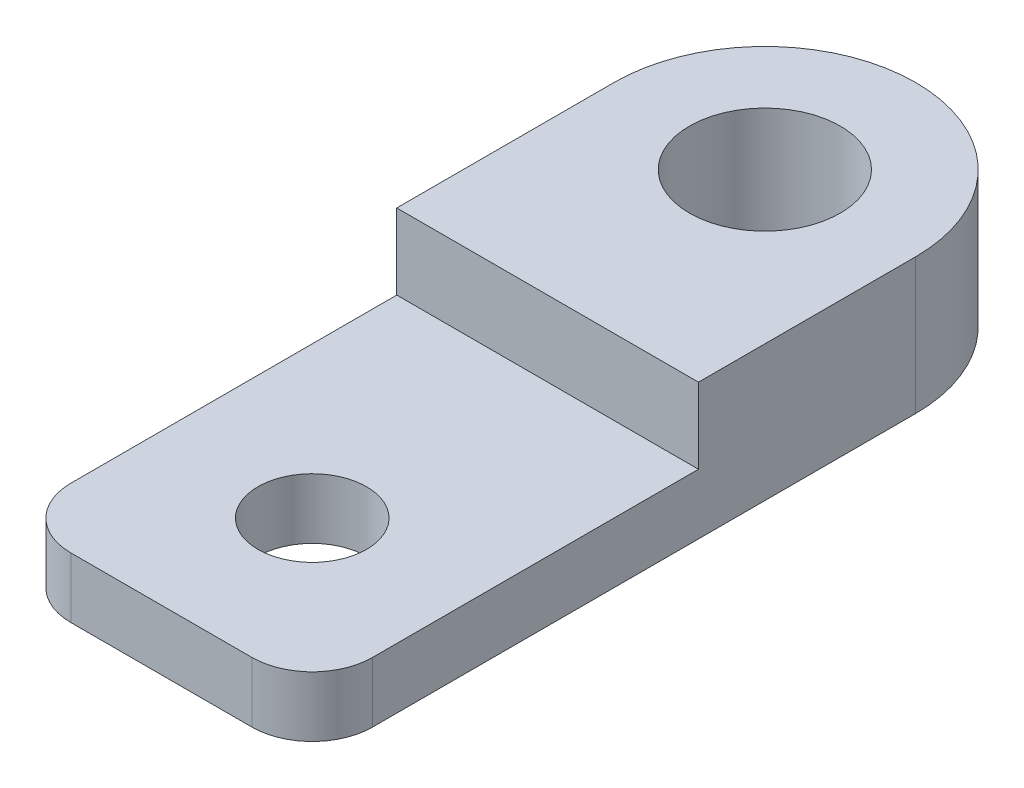
ISO-10303-21;
HEADER;
FILE_DESCRIPTION(('STEP AP214'),'2;1');
FILE_NAME('part.step','',(''),(''),'','','');
FILE_SCHEMA(('AUTOMOTIVE_DESIGN { 1 0 10303 214 1 1 1 1 }'));
ENDSEC;
DATA;
#1=APPLICATION_CONTEXT('core data for automotive mechanical design processes');
#2=APPLICATION_PROTOCOL_DEFINITION('international standard','automotive_design',2000,#1);
#3=PRODUCT_CONTEXT('',#1,'mechanical');
#4=PRODUCT('Part','Part','',(#3));
#5=PRODUCT_RELATED_PRODUCT_CATEGORY('part','',(#4));
#6=PRODUCT_DEFINITION_FORMATION('','',#4);
#7=PRODUCT_DEFINITION_CONTEXT('part definition',#1,'design');
#8=PRODUCT_DEFINITION('design','',#6,#7);
#9=PRODUCT_DEFINITION_SHAPE('','',#8);
#10=(LENGTH_UNIT() NAMED_UNIT(*) SI_UNIT(.MILLI.,.METRE.));
#11=(NAMED_UNIT(*) PLANE_ANGLE_UNIT() SI_UNIT($,.RADIAN.));
#12=(NAMED_UNIT(*) SI_UNIT($,.STERADIAN.) SOLID_ANGLE_UNIT());
#13=UNCERTAINTY_MEASURE_WITH_UNIT(LENGTH_MEASURE(1.E-05),#10,'distance_accuracy_value','');
#14=(GEOMETRIC_REPRESENTATION_CONTEXT(3) GLOBAL_UNCERTAINTY_ASSIGNED_CONTEXT((#13)) GLOBAL_UNIT_ASSIGNED_CONTEXT((#10,
#11,#12)) REPRESENTATION_CONTEXT('',''));
#15=CARTESIAN_POINT('',(0.,0.,0.));
#16=DIRECTION('',(0.,0.,1.));
#17=DIRECTION('',(1.,0.,0.));
#18=AXIS2_PLACEMENT_3D('',#15,#16,#17);
#19=CARTESIAN_POINT('',(6.35,2.54,-25.4));
#20=DIRECTION('',(0.,1.,0.));
#21=DIRECTION('',(0.,0.,1.));
#22=AXIS2_PLACEMENT_3D('',#19,#20,#21);
#23=PLANE('',#22);
#24=DIRECTION('',(1.,0.,0.));
#25=VECTOR('',#24,1.);
#26=CARTESIAN_POINT('',(0.,2.54,-16.256));
#27=LINE('',#26,#25);
#28=CARTESIAN_POINT('',(0.,2.54,-16.256));
#29=VERTEX_POINT('',#28);
#30=CARTESIAN_POINT('',(12.7,2.54,-16.256));
#31=VERTEX_POINT('',#30);
#32=EDGE_CURVE('E52',#29,#31,#27,.T.);
#33=ORIENTED_EDGE('',*,*,#32,.F.);
#34=DIRECTION('',(0.,0.,1.));
#35=VECTOR('',#34,1.);
#36=CARTESIAN_POINT('',(0.,2.54,-2.54000000000002));
#37=LINE('',#36,#35);
#38=CARTESIAN_POINT('',(0.,2.54,-2.54000000000002));
#39=VERTEX_POINT('',#38);
#40=EDGE_CURVE('E91',#29,#39,#37,.T.);
#41=ORIENTED_EDGE('',*,*,#40,.T.);
#42=CARTESIAN_POINT('',(2.54,2.54,-2.54));
#43=DIRECTION('',(0.,1.,0.));
#44=DIRECTION('',(0.,0.,-1.));
#45=AXIS2_PLACEMENT_3D('',#42,#43,#44);
#46=CIRCLE('',#45,2.54);
#47=CARTESIAN_POINT('',(2.54000000000002,2.54,0.));
#48=VERTEX_POINT('',#47);
#49=EDGE_CURVE('E149',#39,#48,#46,.T.);
#50=ORIENTED_EDGE('',*,*,#49,.T.);
#51=DIRECTION('',(1.,0.,0.));
#52=VECTOR('',#51,1.);
#53=CARTESIAN_POINT('',(2.54000000000002,2.54,0.));
#54=LINE('',#53,#52);
#55=CARTESIAN_POINT('',(10.16,2.54,0.));
#56=VERTEX_POINT('',#55);
#57=EDGE_CURVE('E151',#48,#56,#54,.T.);
#58=ORIENTED_EDGE('',*,*,#57,.T.);
#59=CARTESIAN_POINT('',(10.16,2.54,-2.54));
#60=DIRECTION('',(0.,1.,0.));
#61=DIRECTION('',(0.,0.,1.));
#62=AXIS2_PLACEMENT_3D('',#59,#60,#61);
#63=CIRCLE('',#62,2.54);
#64=CARTESIAN_POINT('',(12.7,2.54,-2.54000000000002));
#65=VERTEX_POINT('',#64);
#66=EDGE_CURVE('E59',#56,#65,#63,.T.);
#67=ORIENTED_EDGE('',*,*,#66,.T.);
#68=DIRECTION('',(0.,0.,-1.));
#69=VECTOR('',#68,1.);
#70=CARTESIAN_POINT('',(12.7,2.54,-2.54000000000002));
#71=LINE('',#70,#69);
#72=EDGE_CURVE('E154',#65,#31,#71,.T.);
#73=ORIENTED_EDGE('',*,*,#72,.T.);
#74=EDGE_LOOP('',(#33,#41,#50,#58,#67,#73));
#75=FACE_BOUND('',#74,.T.);
#76=CARTESIAN_POINT('',(6.35,2.54,-6.35));
#77=DIRECTION('',(0.,1.,0.));
#78=DIRECTION('',(0.,0.,1.));
#79=AXIS2_PLACEMENT_3D('',#76,#77,#78);
#80=CIRCLE('',#79,2.286);
#81=CARTESIAN_POINT('',(6.35,2.54,-4.064));
#82=VERTEX_POINT('',#81);
#83=EDGE_CURVE('E140',#82,#82,#80,.T.);
#84=ORIENTED_EDGE('',*,*,#83,.F.);
#85=EDGE_LOOP('',(#84));
#86=FACE_BOUND('',#85,.T.);
#87=ADVANCED_FACE('F37',(#75,#86),#23,.T.);
#88=CARTESIAN_POINT('',(6.35,0.,-25.4));
#89=DIRECTION('',(0.,1.,0.));
#90=DIRECTION('',(0.,0.,1.));
#91=AXIS2_PLACEMENT_3D('',#88,#89,#90);
#92=PLANE('',#91);
#93=CARTESIAN_POINT('',(6.35,0.,-25.4));
#94=DIRECTION('',(0.,1.,0.));
#95=DIRECTION('',(0.,0.,1.));
#96=AXIS2_PLACEMENT_3D('',#93,#94,#95);
#97=CIRCLE('',#96,6.35);
#98=CARTESIAN_POINT('',(12.7,0.,-25.4));
#99=VERTEX_POINT('',#98);
#100=CARTESIAN_POINT('',(0.,0.,-25.4));
#101=VERTEX_POINT('',#100);
#102=EDGE_CURVE('E112',#99,#101,#97,.T.);
#103=ORIENTED_EDGE('',*,*,#102,.F.);
#104=DIRECTION('',(0.,0.,-1.));
#105=VECTOR('',#104,1.);
#106=CARTESIAN_POINT('',(12.7,0.,-2.54000000000002));
#107=LINE('',#106,#105);
#108=CARTESIAN_POINT('',(12.7,0.,-2.54000000000002));
#109=VERTEX_POINT('',#108);
#110=EDGE_CURVE('E87',#109,#99,#107,.T.);
#111=ORIENTED_EDGE('',*,*,#110,.F.);
#112=CARTESIAN_POINT('',(10.16,0.,-2.54));
#113=DIRECTION('',(0.,1.,0.));
#114=DIRECTION('',(0.,0.,1.));
#115=AXIS2_PLACEMENT_3D('',#112,#113,#114);
#116=CIRCLE('',#115,2.54);
#117=CARTESIAN_POINT('',(10.16,0.,0.));
#118=VERTEX_POINT('',#117);
#119=EDGE_CURVE('E164',#118,#109,#116,.T.);
#120=ORIENTED_EDGE('',*,*,#119,.F.);
#121=DIRECTION('',(1.,0.,0.));
#122=VECTOR('',#121,1.);
#123=CARTESIAN_POINT('',(2.54000000000002,0.,0.));
#124=LINE('',#123,#122);
#125=CARTESIAN_POINT('',(2.54000000000002,0.,0.));
#126=VERTEX_POINT('',#125);
#127=EDGE_CURVE('E162',#126,#118,#124,.T.);
#128=ORIENTED_EDGE('',*,*,#127,.F.);
#129=CARTESIAN_POINT('',(2.54,0.,-2.54));
#130=DIRECTION('',(0.,1.,0.));
#131=DIRECTION('',(0.,0.,-1.));
#132=AXIS2_PLACEMENT_3D('',#129,#130,#131);
#133=CIRCLE('',#132,2.54);
#134=CARTESIAN_POINT('',(0.,0.,-2.54000000000002));
#135=VERTEX_POINT('',#134);
#136=EDGE_CURVE('E160',#135,#126,#133,.T.);
#137=ORIENTED_EDGE('',*,*,#136,.F.);
#138=DIRECTION('',(0.,0.,1.));
#139=VECTOR('',#138,1.);
#140=CARTESIAN_POINT('',(0.,0.,-2.54000000000002));
#141=LINE('',#140,#139);
#142=EDGE_CURVE('E158',#101,#135,#141,.T.);
#143=ORIENTED_EDGE('',*,*,#142,.F.);
#144=EDGE_LOOP('',(#103,#111,#120,#128,#137,#143));
#145=FACE_BOUND('',#144,.T.);
#146=CARTESIAN_POINT('',(6.35,0.,-25.4));
#147=DIRECTION('',(0.,1.,0.));
#148=DIRECTION('',(0.,0.,1.));
#149=AXIS2_PLACEMENT_3D('',#146,#147,#148);
#150=CIRCLE('',#149,3.175);
#151=CARTESIAN_POINT('',(6.35,0.,-22.225));
#152=VERTEX_POINT('',#151);
#153=EDGE_CURVE('E143',#152,#152,#150,.T.);
#154=ORIENTED_EDGE('',*,*,#153,.T.);
#155=EDGE_LOOP('',(#154));
#156=FACE_BOUND('',#155,.T.);
#157=CARTESIAN_POINT('',(6.35,0.,-6.35));
#158=DIRECTION('',(0.,1.,0.));
#159=DIRECTION('',(0.,0.,1.));
#160=AXIS2_PLACEMENT_3D('',#157,#158,#159);
#161=CIRCLE('',#160,2.286);
#162=CARTESIAN_POINT('',(6.35,0.,-4.064));
#163=VERTEX_POINT('',#162);
#164=EDGE_CURVE('E139',#163,#163,#161,.T.);
#165=ORIENTED_EDGE('',*,*,#164,.T.);
#166=EDGE_LOOP('',(#165));
#167=FACE_BOUND('',#166,.T.);
#168=ADVANCED_FACE('F183',(#145,#156,#167),#92,.F.);
#169=CARTESIAN_POINT('',(6.35,2.54,-25.4));
#170=DIRECTION('',(0.,-1.,0.));
#171=DIRECTION('',(0.,0.,-1.));
#172=AXIS2_PLACEMENT_3D('',#169,#170,#171);
#173=CYLINDRICAL_SURFACE('',#172,6.35);
#174=ORIENTED_EDGE('',*,*,#102,.T.);
#175=DIRECTION('',(0.,-1.,0.));
#176=VECTOR('',#175,1.);
#177=CARTESIAN_POINT('',(0.,2.54,-25.4));
#178=LINE('',#177,#176);
#179=CARTESIAN_POINT('',(0.,5.715,-25.4));
#180=VERTEX_POINT('',#179);
#181=EDGE_CURVE('E11',#180,#101,#178,.T.);
#182=ORIENTED_EDGE('',*,*,#181,.F.);
#183=CARTESIAN_POINT('',(6.35,5.715,-25.4));
#184=DIRECTION('',(0.,1.,0.));
#185=DIRECTION('',(0.,0.,1.));
#186=AXIS2_PLACEMENT_3D('',#183,#184,#185);
#187=CIRCLE('',#186,6.35);
#188=CARTESIAN_POINT('',(12.7,5.715,-25.4));
#189=VERTEX_POINT('',#188);
#190=EDGE_CURVE('E110',#189,#180,#187,.T.);
#191=ORIENTED_EDGE('',*,*,#190,.F.);
#192=DIRECTION('',(0.,-1.,0.));
#193=VECTOR('',#192,1.);
#194=CARTESIAN_POINT('',(12.7,2.54,-25.4));
#195=LINE('',#194,#193);
#196=EDGE_CURVE('E156',#189,#99,#195,.T.);
#197=ORIENTED_EDGE('',*,*,#196,.T.);
#198=EDGE_LOOP('',(#174,#182,#191,#197));
#199=FACE_BOUND('',#198,.T.);
#200=ADVANCED_FACE('F39',(#199),#173,.T.);
#201=CARTESIAN_POINT('',(0.,2.54,-2.54000000000002));
#202=DIRECTION('',(1.,0.,0.));
#203=DIRECTION('',(0.,0.,-1.));
#204=AXIS2_PLACEMENT_3D('',#201,#202,#203);
#205=PLANE('',#204);
#206=ORIENTED_EDGE('',*,*,#142,.T.);
#207=DIRECTION('',(0.,-1.,0.));
#208=VECTOR('',#207,1.);
#209=CARTESIAN_POINT('',(0.,2.54,-2.54000000000002));
#210=LINE('',#209,#208);
#211=EDGE_CURVE('E45',#39,#135,#210,.T.);
#212=ORIENTED_EDGE('',*,*,#211,.F.);
#213=ORIENTED_EDGE('',*,*,#40,.F.);
#214=DIRECTION('',(0.,-1.,0.));
#215=VECTOR('',#214,1.);
#216=CARTESIAN_POINT('',(0.,5.715,-16.256));
#217=LINE('',#216,#215);
#218=CARTESIAN_POINT('',(0.,5.715,-16.256));
#219=VERTEX_POINT('',#218);
#220=EDGE_CURVE('E118',#219,#29,#217,.T.);
#221=ORIENTED_EDGE('',*,*,#220,.F.);
#222=DIRECTION('',(0.,0.,1.));
#223=VECTOR('',#222,1.);
#224=CARTESIAN_POINT('',(0.,5.715,-25.4));
#225=LINE('',#224,#223);
#226=EDGE_CURVE('E115',#180,#219,#225,.T.);
#227=ORIENTED_EDGE('',*,*,#226,.F.);
#228=ORIENTED_EDGE('',*,*,#181,.T.);
#229=EDGE_LOOP('',(#206,#212,#213,#221,#227,#228));
#230=FACE_BOUND('',#229,.T.);
#231=ADVANCED_FACE('F116',(#230),#205,.F.);
#232=CARTESIAN_POINT('',(2.54,2.54,-2.54));
#233=DIRECTION('',(0.,-1.,0.));
#234=DIRECTION('',(0.,0.,-1.));
#235=AXIS2_PLACEMENT_3D('',#232,#233,#234);
#236=CYLINDRICAL_SURFACE('',#235,2.54);
#237=ORIENTED_EDGE('',*,*,#136,.T.);
#238=DIRECTION('',(0.,-1.,0.));
#239=VECTOR('',#238,1.);
#240=CARTESIAN_POINT('',(2.54000000000002,2.54,0.));
#241=LINE('',#240,#239);
#242=EDGE_CURVE('E173',#48,#126,#241,.T.);
#243=ORIENTED_EDGE('',*,*,#242,.F.);
#244=ORIENTED_EDGE('',*,*,#49,.F.);
#245=ORIENTED_EDGE('',*,*,#211,.T.);
#246=EDGE_LOOP('',(#237,#243,#244,#245));
#247=FACE_BOUND('',#246,.T.);
#248=ADVANCED_FACE('F179',(#247),#236,.T.);
#249=CARTESIAN_POINT('',(2.54000000000002,2.54,0.));
#250=DIRECTION('',(0.,0.,-1.));
#251=DIRECTION('',(-1.,0.,0.));
#252=AXIS2_PLACEMENT_3D('',#249,#250,#251);
#253=PLANE('',#252);
#254=ORIENTED_EDGE('',*,*,#127,.T.);
#255=DIRECTION('',(0.,-1.,0.));
#256=VECTOR('',#255,1.);
#257=CARTESIAN_POINT('',(10.16,2.54,0.));
#258=LINE('',#257,#256);
#259=EDGE_CURVE('E170',#56,#118,#258,.T.);
#260=ORIENTED_EDGE('',*,*,#259,.F.);
#261=ORIENTED_EDGE('',*,*,#57,.F.);
#262=ORIENTED_EDGE('',*,*,#242,.T.);
#263=EDGE_LOOP('',(#254,#260,#261,#262));
#264=FACE_BOUND('',#263,.T.);
#265=ADVANCED_FACE('F188',(#264),#253,.F.);
#266=CARTESIAN_POINT('',(10.16,2.54,-2.54));
#267=DIRECTION('',(0.,-1.,0.));
#268=DIRECTION('',(0.,0.,-1.));
#269=AXIS2_PLACEMENT_3D('',#266,#267,#268);
#270=CYLINDRICAL_SURFACE('',#269,2.54);
#271=ORIENTED_EDGE('',*,*,#119,.T.);
#272=DIRECTION('',(0.,-1.,0.));
#273=VECTOR('',#272,1.);
#274=CARTESIAN_POINT('',(12.7,2.54,-2.54000000000002));
#275=LINE('',#274,#273);
#276=EDGE_CURVE('E168',#65,#109,#275,.T.);
#277=ORIENTED_EDGE('',*,*,#276,.F.);
#278=ORIENTED_EDGE('',*,*,#66,.F.);
#279=ORIENTED_EDGE('',*,*,#259,.T.);
#280=EDGE_LOOP('',(#271,#277,#278,#279));
#281=FACE_BOUND('',#280,.T.);
#282=ADVANCED_FACE('F191',(#281),#270,.T.);
#283=CARTESIAN_POINT('',(12.7,2.54,-2.54000000000002));
#284=DIRECTION('',(-1.,0.,0.));
#285=DIRECTION('',(0.,0.,1.));
#286=AXIS2_PLACEMENT_3D('',#283,#284,#285);
#287=PLANE('',#286);
#288=ORIENTED_EDGE('',*,*,#110,.T.);
#289=ORIENTED_EDGE('',*,*,#196,.F.);
#290=DIRECTION('',(0.,0.,-1.));
#291=VECTOR('',#290,1.);
#292=CARTESIAN_POINT('',(12.7,5.715,-16.256));
#293=LINE('',#292,#291);
#294=CARTESIAN_POINT('',(12.7,5.715,-16.256));
#295=VERTEX_POINT('',#294);
#296=EDGE_CURVE('E127',#295,#189,#293,.T.);
#297=ORIENTED_EDGE('',*,*,#296,.F.);
#298=DIRECTION('',(0.,-1.,0.));
#299=VECTOR('',#298,1.);
#300=CARTESIAN_POINT('',(12.7,5.715,-16.256));
#301=LINE('',#300,#299);
#302=EDGE_CURVE('E134',#295,#31,#301,.T.);
#303=ORIENTED_EDGE('',*,*,#302,.T.);
#304=ORIENTED_EDGE('',*,*,#72,.F.);
#305=ORIENTED_EDGE('',*,*,#276,.T.);
#306=EDGE_LOOP('',(#288,#289,#297,#303,#304,#305));
#307=FACE_BOUND('',#306,.T.);
#308=ADVANCED_FACE('F193',(#307),#287,.F.);
#309=CARTESIAN_POINT('',(6.35,2.54,-25.4));
#310=DIRECTION('',(0.,-1.,0.));
#311=DIRECTION('',(0.,0.,-1.));
#312=AXIS2_PLACEMENT_3D('',#309,#310,#311);
#313=CYLINDRICAL_SURFACE('',#312,3.175);
#314=ORIENTED_EDGE('',*,*,#153,.F.);
#315=EDGE_LOOP('',(#314));
#316=FACE_BOUND('',#315,.T.);
#317=CARTESIAN_POINT('',(6.35,5.715,-25.4));
#318=DIRECTION('',(0.,1.,0.));
#319=DIRECTION('',(0.,0.,1.));
#320=AXIS2_PLACEMENT_3D('',#317,#318,#319);
#321=CIRCLE('',#320,3.175);
#322=CARTESIAN_POINT('',(6.35,5.715,-22.225));
#323=VERTEX_POINT('',#322);
#324=EDGE_CURVE('E129',#323,#323,#321,.T.);
#325=ORIENTED_EDGE('',*,*,#324,.T.);
#326=EDGE_LOOP('',(#325));
#327=FACE_BOUND('',#326,.T.);
#328=ADVANCED_FACE('F213',(#316,#327),#313,.F.);
#329=CARTESIAN_POINT('',(6.35,2.54,-6.35));
#330=DIRECTION('',(0.,-1.,0.));
#331=DIRECTION('',(0.,0.,-1.));
#332=AXIS2_PLACEMENT_3D('',#329,#330,#331);
#333=CYLINDRICAL_SURFACE('',#332,2.286);
#334=ORIENTED_EDGE('',*,*,#83,.T.);
#335=EDGE_LOOP('',(#334));
#336=FACE_BOUND('',#335,.T.);
#337=ORIENTED_EDGE('',*,*,#164,.F.);
#338=EDGE_LOOP('',(#337));
#339=FACE_BOUND('',#338,.T.);
#340=ADVANCED_FACE('F203',(#336,#339),#333,.F.);
#341=CARTESIAN_POINT('',(6.35,5.715,-25.4));
#342=DIRECTION('',(0.,1.,0.));
#343=DIRECTION('',(0.,0.,1.));
#344=AXIS2_PLACEMENT_3D('',#341,#342,#343);
#345=PLANE('',#344);
#346=ORIENTED_EDGE('',*,*,#190,.T.);
#347=ORIENTED_EDGE('',*,*,#226,.T.);
#348=DIRECTION('',(1.,0.,0.));
#349=VECTOR('',#348,1.);
#350=CARTESIAN_POINT('',(0.,5.715,-16.256));
#351=LINE('',#350,#349);
#352=EDGE_CURVE('E121',#219,#295,#351,.T.);
#353=ORIENTED_EDGE('',*,*,#352,.T.);
#354=ORIENTED_EDGE('',*,*,#296,.T.);
#355=EDGE_LOOP('',(#346,#347,#353,#354));
#356=FACE_BOUND('',#355,.T.);
#357=ORIENTED_EDGE('',*,*,#324,.F.);
#358=EDGE_LOOP('',(#357));
#359=FACE_BOUND('',#358,.T.);
#360=ADVANCED_FACE('F124',(#356,#359),#345,.T.);
#361=CARTESIAN_POINT('',(0.,5.715,-16.256));
#362=DIRECTION('',(0.,0.,-1.));
#363=DIRECTION('',(-1.,0.,0.));
#364=AXIS2_PLACEMENT_3D('',#361,#362,#363);
#365=PLANE('',#364);
#366=ORIENTED_EDGE('',*,*,#32,.T.);
#367=ORIENTED_EDGE('',*,*,#302,.F.);
#368=ORIENTED_EDGE('',*,*,#352,.F.);
#369=ORIENTED_EDGE('',*,*,#220,.T.);
#370=EDGE_LOOP('',(#366,#367,#368,#369));
#371=FACE_BOUND('',#370,.T.);
#372=ADVANCED_FACE('F197',(#371),#365,.F.);
#373=CLOSED_SHELL('',(#87,#168,#200,#231,#248,#265,#282,#308,#328,#340,#360,#372));
#374=MANIFOLD_SOLID_BREP('B2',#373);
#375=ADVANCED_BREP_SHAPE_REPRESENTATION('',(#18,#374),#14);
#376=SHAPE_DEFINITION_REPRESENTATION(#9,#375);
ENDSEC;
END-ISO-10303-21;
